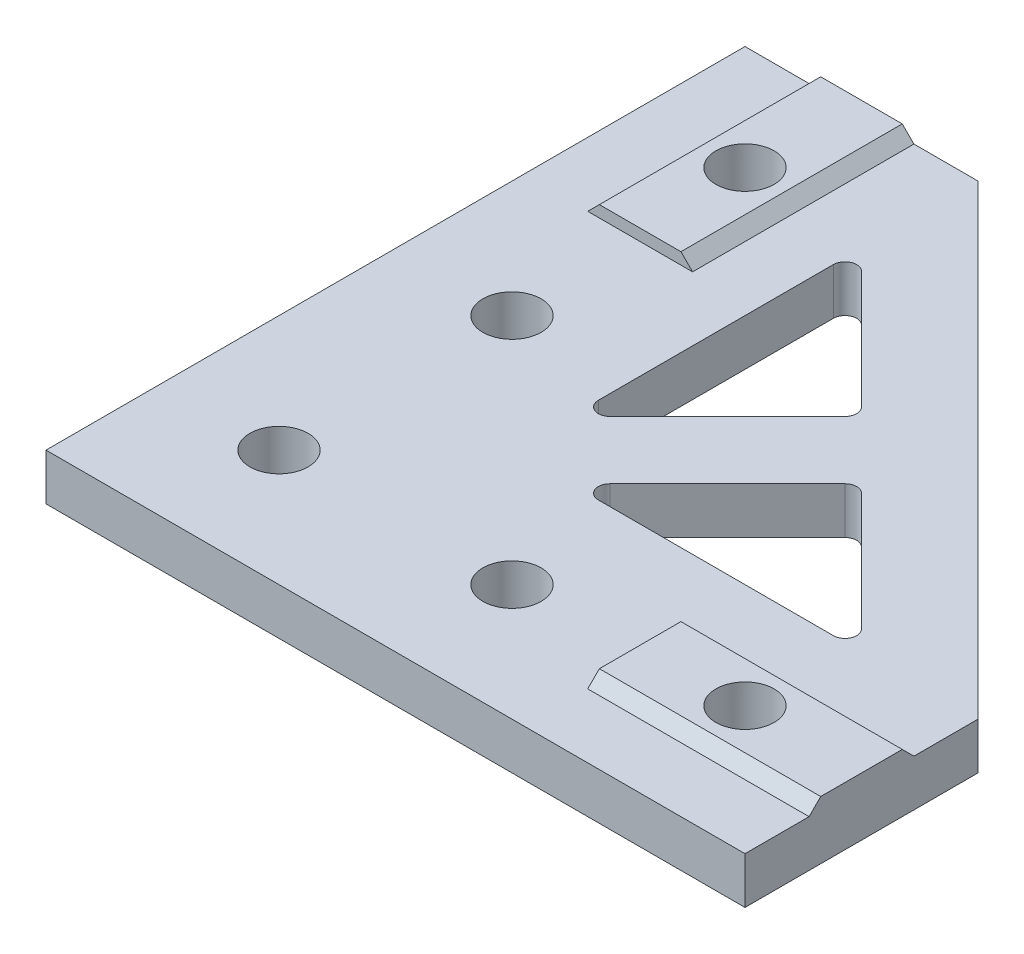
ISO-10303-21;
HEADER;
FILE_DESCRIPTION(('STEP AP214'),'2;1');
FILE_NAME('part.step','',(''),(''),'','','');
FILE_SCHEMA(('AUTOMOTIVE_DESIGN { 1 0 10303 214 1 1 1 1 }'));
ENDSEC;
DATA;
#1=APPLICATION_CONTEXT('core data for automotive mechanical design processes');
#2=APPLICATION_PROTOCOL_DEFINITION('international standard','automotive_design',2000,#1);
#3=PRODUCT_CONTEXT('',#1,'mechanical');
#4=PRODUCT('Part','Part','',(#3));
#5=PRODUCT_RELATED_PRODUCT_CATEGORY('part','',(#4));
#6=PRODUCT_DEFINITION_FORMATION('','',#4);
#7=PRODUCT_DEFINITION_CONTEXT('part definition',#1,'design');
#8=PRODUCT_DEFINITION('design','',#6,#7);
#9=PRODUCT_DEFINITION_SHAPE('','',#8);
#10=(LENGTH_UNIT() NAMED_UNIT(*) SI_UNIT(.MILLI.,.METRE.));
#11=(NAMED_UNIT(*) PLANE_ANGLE_UNIT() SI_UNIT($,.RADIAN.));
#12=(NAMED_UNIT(*) SI_UNIT($,.STERADIAN.) SOLID_ANGLE_UNIT());
#13=UNCERTAINTY_MEASURE_WITH_UNIT(LENGTH_MEASURE(1.E-05),#10,'distance_accuracy_value','');
#14=(GEOMETRIC_REPRESENTATION_CONTEXT(3) GLOBAL_UNCERTAINTY_ASSIGNED_CONTEXT((#13)) GLOBAL_UNIT_ASSIGNED_CONTEXT((#10,
#11,#12)) REPRESENTATION_CONTEXT('',''));
#15=CARTESIAN_POINT('',(0.,0.,0.));
#16=DIRECTION('',(0.,0.,1.));
#17=DIRECTION('',(1.,0.,0.));
#18=AXIS2_PLACEMENT_3D('',#15,#16,#17);
#19=CARTESIAN_POINT('',(0.,4.,0.));
#20=DIRECTION('',(0.,1.,0.));
#21=DIRECTION('',(0.,0.,1.));
#22=AXIS2_PLACEMENT_3D('',#19,#20,#21);
#23=PLANE('',#22);
#24=CARTESIAN_POINT('',(47.5858823380867,4.,-21.));
#25=DIRECTION('',(0.,1.,0.));
#26=DIRECTION('',(0.,0.,1.));
#27=AXIS2_PLACEMENT_3D('',#24,#25,#26);
#28=CIRCLE('',#27,1.);
#29=CARTESIAN_POINT('',(47.5858823380867,4.,-20.));
#30=VERTEX_POINT('',#29);
#31=CARTESIAN_POINT('',(48.2929891192733,4.,-21.7071067811866));
#32=VERTEX_POINT('',#31);
#33=EDGE_CURVE('E146',#30,#32,#28,.T.);
#34=ORIENTED_EDGE('',*,*,#33,.F.);
#35=DIRECTION('',(1.,0.,0.));
#36=VECTOR('',#35,1.);
#37=CARTESIAN_POINT('',(0.,4.,-20.));
#38=LINE('',#37,#36);
#39=CARTESIAN_POINT('',(27.4141656121432,4.,-20.));
#40=VERTEX_POINT('',#39);
#41=EDGE_CURVE('E104',#40,#30,#38,.T.);
#42=ORIENTED_EDGE('',*,*,#41,.F.);
#43=CARTESIAN_POINT('',(27.4141656121432,4.,-21.));
#44=DIRECTION('',(0.,1.,0.));
#45=DIRECTION('',(0.,0.,1.));
#46=AXIS2_PLACEMENT_3D('',#43,#44,#45);
#47=CIRCLE('',#46,1.);
#48=CARTESIAN_POINT('',(26.7070588309566,4.,-21.7071067811866));
#49=VERTEX_POINT('',#48);
#50=EDGE_CURVE('E350',#49,#40,#47,.T.);
#51=ORIENTED_EDGE('',*,*,#50,.F.);
#52=DIRECTION('',(-0.707106781186548,0.,0.707106781186548));
#53=VECTOR('',#52,1.);
#54=CARTESIAN_POINT('',(2.49997602488504,4.,2.49997602488504));
#55=LINE('',#54,#53);
#56=CARTESIAN_POINT('',(36.7929171939284,4.,-31.7929651441583));
#57=VERTEX_POINT('',#56);
#58=EDGE_CURVE('E352',#57,#49,#55,.T.);
#59=ORIENTED_EDGE('',*,*,#58,.F.);
#60=CARTESIAN_POINT('',(37.500023975115,4.,-31.0858583629718));
#61=DIRECTION('',(0.,1.,0.));
#62=DIRECTION('',(0.,0.,1.));
#63=AXIS2_PLACEMENT_3D('',#60,#61,#62);
#64=CIRCLE('',#63,1.);
#65=CARTESIAN_POINT('',(38.2071307563015,4.,-31.7929651441583));
#66=VERTEX_POINT('',#65);
#67=EDGE_CURVE('E355',#66,#57,#64,.T.);
#68=ORIENTED_EDGE('',*,*,#67,.F.);
#69=DIRECTION('',(-0.707106781186547,0.,-0.707106781186548));
#70=VECTOR('',#69,1.);
#71=CARTESIAN_POINT('',(35.0000479502299,4.,-35.0000479502299));
#72=LINE('',#71,#70);
#73=EDGE_CURVE('E358',#32,#66,#72,.T.);
#74=ORIENTED_EDGE('',*,*,#73,.F.);
#75=EDGE_LOOP('',(#34,#42,#51,#59,#68,#74));
#76=FACE_BOUND('',#75,.T.);
#77=CARTESIAN_POINT('',(31.0858583629718,4.,-37.500023975115));
#78=DIRECTION('',(0.,1.,0.));
#79=DIRECTION('',(0.,0.,1.));
#80=AXIS2_PLACEMENT_3D('',#77,#78,#79);
#81=CIRCLE('',#80,1.);
#82=CARTESIAN_POINT('',(31.7929651441583,4.,-36.7929171939284));
#83=VERTEX_POINT('',#82);
#84=CARTESIAN_POINT('',(31.7929651441583,4.,-38.2071307563015));
#85=VERTEX_POINT('',#84);
#86=EDGE_CURVE('E300',#83,#85,#81,.T.);
#87=ORIENTED_EDGE('',*,*,#86,.F.);
#88=DIRECTION('',(0.707106781186548,0.,-0.707106781186547));
#89=VECTOR('',#88,1.);
#90=CARTESIAN_POINT('',(-2.49997602488504,4.,-2.49997602488504));
#91=LINE('',#90,#89);
#92=CARTESIAN_POINT('',(21.7071067811865,4.,-26.7070588309566));
#93=VERTEX_POINT('',#92);
#94=EDGE_CURVE('E334',#93,#83,#91,.T.);
#95=ORIENTED_EDGE('',*,*,#94,.F.);
#96=CARTESIAN_POINT('',(21.,4.,-27.4141656121432));
#97=DIRECTION('',(0.,1.,0.));
#98=DIRECTION('',(0.,0.,1.));
#99=AXIS2_PLACEMENT_3D('',#96,#97,#98);
#100=CIRCLE('',#99,0.999999999999998);
#101=CARTESIAN_POINT('',(20.,4.,-27.4141656121432));
#102=VERTEX_POINT('',#101);
#103=EDGE_CURVE('E337',#102,#93,#100,.T.);
#104=ORIENTED_EDGE('',*,*,#103,.F.);
#105=DIRECTION('',(0.,0.,1.));
#106=VECTOR('',#105,1.);
#107=CARTESIAN_POINT('',(20.,4.,0.));
#108=LINE('',#107,#106);
#109=CARTESIAN_POINT('',(20.,4.,-47.5858823380867));
#110=VERTEX_POINT('',#109);
#111=EDGE_CURVE('E340',#110,#102,#108,.T.);
#112=ORIENTED_EDGE('',*,*,#111,.F.);
#113=CARTESIAN_POINT('',(21.,4.,-47.5858823380867));
#114=DIRECTION('',(0.,1.,0.));
#115=DIRECTION('',(0.,0.,1.));
#116=AXIS2_PLACEMENT_3D('',#113,#114,#115);
#117=CIRCLE('',#116,1.);
#118=CARTESIAN_POINT('',(21.7071067811866,4.,-48.2929891192733));
#119=VERTEX_POINT('',#118);
#120=EDGE_CURVE('E343',#119,#110,#117,.T.);
#121=ORIENTED_EDGE('',*,*,#120,.F.);
#122=DIRECTION('',(-0.707106781186548,0.,-0.707106781186547));
#123=VECTOR('',#122,1.);
#124=CARTESIAN_POINT('',(35.0000479502299,4.,-35.0000479502299));
#125=LINE('',#124,#123);
#126=EDGE_CURVE('E346',#85,#119,#125,.T.);
#127=ORIENTED_EDGE('',*,*,#126,.F.);
#128=EDGE_LOOP('',(#87,#95,#104,#112,#121,#127));
#129=FACE_BOUND('',#128,.T.);
#130=CARTESIAN_POINT('',(10.,4.,-30.));
#131=DIRECTION('',(0.,1.,0.));
#132=DIRECTION('',(0.,0.,1.));
#133=AXIS2_PLACEMENT_3D('',#130,#131,#132);
#134=CIRCLE('',#133,2.5);
#135=CARTESIAN_POINT('',(10.,4.,-27.5));
#136=VERTEX_POINT('',#135);
#137=EDGE_CURVE('E272',#136,#136,#134,.T.);
#138=ORIENTED_EDGE('',*,*,#137,.F.);
#139=EDGE_LOOP('',(#138));
#140=FACE_BOUND('',#139,.T.);
#141=CARTESIAN_POINT('',(10.,4.,-10.));
#142=DIRECTION('',(0.,1.,0.));
#143=DIRECTION('',(0.,0.,1.));
#144=AXIS2_PLACEMENT_3D('',#141,#142,#143);
#145=CIRCLE('',#144,2.5);
#146=CARTESIAN_POINT('',(10.,4.,-7.5));
#147=VERTEX_POINT('',#146);
#148=EDGE_CURVE('E268',#147,#147,#145,.T.);
#149=ORIENTED_EDGE('',*,*,#148,.F.);
#150=EDGE_LOOP('',(#149));
#151=FACE_BOUND('',#150,.T.);
#152=CARTESIAN_POINT('',(30.,4.,-10.));
#153=DIRECTION('',(0.,1.,0.));
#154=DIRECTION('',(0.,0.,1.));
#155=AXIS2_PLACEMENT_3D('',#152,#153,#154);
#156=CIRCLE('',#155,2.50000000000001);
#157=CARTESIAN_POINT('',(30.,4.,-7.49999999999999));
#158=VERTEX_POINT('',#157);
#159=EDGE_CURVE('E263',#158,#158,#156,.T.);
#160=ORIENTED_EDGE('',*,*,#159,.F.);
#161=EDGE_LOOP('',(#160));
#162=FACE_BOUND('',#161,.T.);
#163=DIRECTION('',(0.,0.,1.));
#164=VECTOR('',#163,1.);
#165=CARTESIAN_POINT('',(41.,4.,-5.5));
#166=LINE('',#165,#164);
#167=CARTESIAN_POINT('',(41.,4.,-14.5));
#168=VERTEX_POINT('',#167);
#169=CARTESIAN_POINT('',(41.,4.,-5.5));
#170=VERTEX_POINT('',#169);
#171=EDGE_CURVE('E378',#168,#170,#166,.T.);
#172=ORIENTED_EDGE('',*,*,#171,.F.);
#173=DIRECTION('',(-1.,0.,0.));
#174=VECTOR('',#173,1.);
#175=CARTESIAN_POINT('',(60.,4.,-14.5));
#176=LINE('',#175,#174);
#177=CARTESIAN_POINT('',(60.,4.,-14.5));
#178=VERTEX_POINT('',#177);
#179=EDGE_CURVE('E367',#178,#168,#176,.T.);
#180=ORIENTED_EDGE('',*,*,#179,.F.);
#181=DIRECTION('',(0.,0.,-1.));
#182=VECTOR('',#181,1.);
#183=CARTESIAN_POINT('',(60.,4.,0.));
#184=LINE('',#183,#182);
#185=CARTESIAN_POINT('',(60.,4.,-20.));
#186=VERTEX_POINT('',#185);
#187=EDGE_CURVE('E391',#178,#186,#184,.T.);
#188=ORIENTED_EDGE('',*,*,#187,.T.);
#189=DIRECTION('',(-0.707106781186548,0.,-0.707106781186548));
#190=VECTOR('',#189,1.);
#191=CARTESIAN_POINT('',(60.,4.,-20.));
#192=LINE('',#191,#190);
#193=CARTESIAN_POINT('',(20.,4.,-60.));
#194=VERTEX_POINT('',#193);
#195=EDGE_CURVE('E396',#186,#194,#192,.T.);
#196=ORIENTED_EDGE('',*,*,#195,.T.);
#197=DIRECTION('',(-1.,0.,0.));
#198=VECTOR('',#197,1.);
#199=CARTESIAN_POINT('',(20.,4.,-60.));
#200=LINE('',#199,#198);
#201=CARTESIAN_POINT('',(14.5,4.,-60.));
#202=VERTEX_POINT('',#201);
#203=EDGE_CURVE('E399',#194,#202,#200,.T.);
#204=ORIENTED_EDGE('',*,*,#203,.T.);
#205=DIRECTION('',(0.,0.,-1.));
#206=VECTOR('',#205,1.);
#207=CARTESIAN_POINT('',(14.5,4.,-60.));
#208=LINE('',#207,#206);
#209=CARTESIAN_POINT('',(14.5,4.,-41.));
#210=VERTEX_POINT('',#209);
#211=EDGE_CURVE('E375',#210,#202,#208,.T.);
#212=ORIENTED_EDGE('',*,*,#211,.F.);
#213=DIRECTION('',(1.,0.,0.));
#214=VECTOR('',#213,1.);
#215=CARTESIAN_POINT('',(14.5,4.,-41.));
#216=LINE('',#215,#214);
#217=CARTESIAN_POINT('',(5.5,4.,-41.));
#218=VERTEX_POINT('',#217);
#219=EDGE_CURVE('E230',#218,#210,#216,.T.);
#220=ORIENTED_EDGE('',*,*,#219,.F.);
#221=DIRECTION('',(0.,0.,1.));
#222=VECTOR('',#221,1.);
#223=CARTESIAN_POINT('',(5.5,4.,-60.));
#224=LINE('',#223,#222);
#225=CARTESIAN_POINT('',(5.5,4.,-60.));
#226=VERTEX_POINT('',#225);
#227=EDGE_CURVE('E384',#226,#218,#224,.T.);
#228=ORIENTED_EDGE('',*,*,#227,.F.);
#229=CARTESIAN_POINT('',(0.,4.,-60.));
#230=VERTEX_POINT('',#229);
#231=EDGE_CURVE('E398',#226,#230,#200,.T.);
#232=ORIENTED_EDGE('',*,*,#231,.T.);
#233=DIRECTION('',(0.,0.,1.));
#234=VECTOR('',#233,1.);
#235=CARTESIAN_POINT('',(0.,4.,0.));
#236=LINE('',#235,#234);
#237=CARTESIAN_POINT('',(0.,4.,0.));
#238=VERTEX_POINT('',#237);
#239=EDGE_CURVE('E402',#230,#238,#236,.T.);
#240=ORIENTED_EDGE('',*,*,#239,.T.);
#241=DIRECTION('',(1.,0.,0.));
#242=VECTOR('',#241,1.);
#243=CARTESIAN_POINT('',(0.,4.,0.));
#244=LINE('',#243,#242);
#245=CARTESIAN_POINT('',(60.,4.,0.));
#246=VERTEX_POINT('',#245);
#247=EDGE_CURVE('E388',#238,#246,#244,.T.);
#248=ORIENTED_EDGE('',*,*,#247,.T.);
#249=CARTESIAN_POINT('',(60.,4.,-5.5));
#250=VERTEX_POINT('',#249);
#251=EDGE_CURVE('E393',#246,#250,#184,.T.);
#252=ORIENTED_EDGE('',*,*,#251,.T.);
#253=DIRECTION('',(1.,0.,0.));
#254=VECTOR('',#253,1.);
#255=CARTESIAN_POINT('',(60.,4.,-5.5));
#256=LINE('',#255,#254);
#257=EDGE_CURVE('E372',#170,#250,#256,.T.);
#258=ORIENTED_EDGE('',*,*,#257,.F.);
#259=EDGE_LOOP('',(#172,#180,#188,#196,#204,#212,#220,#228,#232,#240,#248,#252,#258));
#260=FACE_BOUND('',#259,.T.);
#261=ADVANCED_FACE('F33',(#76,#129,#140,#151,#162,#260),#23,.T.);
#262=CARTESIAN_POINT('',(0.,4.,0.));
#263=DIRECTION('',(0.,0.,-1.));
#264=DIRECTION('',(-1.,0.,0.));
#265=AXIS2_PLACEMENT_3D('',#262,#263,#264);
#266=PLANE('',#265);
#267=DIRECTION('',(1.,0.,0.));
#268=VECTOR('',#267,1.);
#269=CARTESIAN_POINT('',(0.,0.,0.));
#270=LINE('',#269,#268);
#271=CARTESIAN_POINT('',(0.,0.,0.));
#272=VERTEX_POINT('',#271);
#273=CARTESIAN_POINT('',(60.,0.,0.));
#274=VERTEX_POINT('',#273);
#275=EDGE_CURVE('E246',#272,#274,#270,.T.);
#276=ORIENTED_EDGE('',*,*,#275,.T.);
#277=DIRECTION('',(0.,-1.,0.));
#278=VECTOR('',#277,1.);
#279=CARTESIAN_POINT('',(60.,4.,0.));
#280=LINE('',#279,#278);
#281=EDGE_CURVE('E425',#246,#274,#280,.T.);
#282=ORIENTED_EDGE('',*,*,#281,.F.);
#283=ORIENTED_EDGE('',*,*,#247,.F.);
#284=DIRECTION('',(0.,-1.,0.));
#285=VECTOR('',#284,1.);
#286=CARTESIAN_POINT('',(0.,4.,0.));
#287=LINE('',#286,#285);
#288=EDGE_CURVE('E404',#238,#272,#287,.T.);
#289=ORIENTED_EDGE('',*,*,#288,.T.);
#290=EDGE_LOOP('',(#276,#282,#283,#289));
#291=FACE_BOUND('',#290,.T.);
#292=ADVANCED_FACE('F465',(#291),#266,.F.);
#293=CARTESIAN_POINT('',(60.,4.,0.));
#294=DIRECTION('',(-1.,0.,0.));
#295=DIRECTION('',(0.,0.,1.));
#296=AXIS2_PLACEMENT_3D('',#293,#294,#295);
#297=PLANE('',#296);
#298=ORIENTED_EDGE('',*,*,#187,.F.);
#299=DIRECTION('',(0.,0.70710678118655,0.707106781186545));
#300=VECTOR('',#299,1.);
#301=CARTESIAN_POINT('',(60.,5.00000000000001,-13.5));
#302=LINE('',#301,#300);
#303=CARTESIAN_POINT('',(60.,5.,-13.5));
#304=VERTEX_POINT('',#303);
#305=EDGE_CURVE('E254',#178,#304,#302,.T.);
#306=ORIENTED_EDGE('',*,*,#305,.T.);
#307=DIRECTION('',(0.,0.,-1.));
#308=VECTOR('',#307,1.);
#309=CARTESIAN_POINT('',(60.,5.,-5.5));
#310=LINE('',#309,#308);
#311=CARTESIAN_POINT('',(60.,5.,-6.49999999999999));
#312=VERTEX_POINT('',#311);
#313=EDGE_CURVE('E368',#312,#304,#310,.T.);
#314=ORIENTED_EDGE('',*,*,#313,.F.);
#315=DIRECTION('',(0.,-0.70710678118655,0.707106781186545));
#316=VECTOR('',#315,1.);
#317=CARTESIAN_POINT('',(60.,5.,-6.49999999999999));
#318=LINE('',#317,#316);
#319=EDGE_CURVE('E438',#312,#250,#318,.T.);
#320=ORIENTED_EDGE('',*,*,#319,.T.);
#321=ORIENTED_EDGE('',*,*,#251,.F.);
#322=ORIENTED_EDGE('',*,*,#281,.T.);
#323=DIRECTION('',(0.,0.,-1.));
#324=VECTOR('',#323,1.);
#325=CARTESIAN_POINT('',(60.,0.,0.));
#326=LINE('',#325,#324);
#327=CARTESIAN_POINT('',(60.,0.,-20.));
#328=VERTEX_POINT('',#327);
#329=EDGE_CURVE('E407',#274,#328,#326,.T.);
#330=ORIENTED_EDGE('',*,*,#329,.T.);
#331=DIRECTION('',(0.,-1.,0.));
#332=VECTOR('',#331,1.);
#333=CARTESIAN_POINT('',(60.,4.,-20.));
#334=LINE('',#333,#332);
#335=EDGE_CURVE('E422',#186,#328,#334,.T.);
#336=ORIENTED_EDGE('',*,*,#335,.F.);
#337=EDGE_LOOP('',(#298,#306,#314,#320,#321,#322,#330,#336));
#338=FACE_BOUND('',#337,.T.);
#339=ADVANCED_FACE('F443',(#338),#297,.F.);
#340=CARTESIAN_POINT('',(60.,4.,-20.));
#341=DIRECTION('',(-0.707106781186547,0.,0.707106781186547));
#342=DIRECTION('',(0.707106781186548,0.,0.707106781186548));
#343=AXIS2_PLACEMENT_3D('',#340,#341,#342);
#344=PLANE('',#343);
#345=DIRECTION('',(-0.707106781186548,0.,-0.707106781186548));
#346=VECTOR('',#345,1.);
#347=CARTESIAN_POINT('',(60.,0.,-20.));
#348=LINE('',#347,#346);
#349=CARTESIAN_POINT('',(20.,0.,-60.));
#350=VERTEX_POINT('',#349);
#351=EDGE_CURVE('E409',#328,#350,#348,.T.);
#352=ORIENTED_EDGE('',*,*,#351,.T.);
#353=DIRECTION('',(0.,-1.,0.));
#354=VECTOR('',#353,1.);
#355=CARTESIAN_POINT('',(20.,4.,-60.));
#356=LINE('',#355,#354);
#357=EDGE_CURVE('E419',#194,#350,#356,.T.);
#358=ORIENTED_EDGE('',*,*,#357,.F.);
#359=ORIENTED_EDGE('',*,*,#195,.F.);
#360=ORIENTED_EDGE('',*,*,#335,.T.);
#361=EDGE_LOOP('',(#352,#358,#359,#360));
#362=FACE_BOUND('',#361,.T.);
#363=ADVANCED_FACE('F473',(#362),#344,.F.);
#364=CARTESIAN_POINT('',(20.,4.,-60.));
#365=DIRECTION('',(0.,0.,1.));
#366=DIRECTION('',(1.,0.,0.));
#367=AXIS2_PLACEMENT_3D('',#364,#365,#366);
#368=PLANE('',#367);
#369=DIRECTION('',(-1.,0.,0.));
#370=VECTOR('',#369,1.);
#371=CARTESIAN_POINT('',(14.5,5.,-60.));
#372=LINE('',#371,#370);
#373=CARTESIAN_POINT('',(13.5,5.,-60.));
#374=VERTEX_POINT('',#373);
#375=CARTESIAN_POINT('',(6.49999999999999,5.,-60.));
#376=VERTEX_POINT('',#375);
#377=EDGE_CURVE('E247',#374,#376,#372,.T.);
#378=ORIENTED_EDGE('',*,*,#377,.F.);
#379=DIRECTION('',(-0.707106781186545,0.707106781186551,0.));
#380=VECTOR('',#379,1.);
#381=CARTESIAN_POINT('',(13.5,5.,-60.));
#382=LINE('',#381,#380);
#383=EDGE_CURVE('E250',#374,#202,#382,.F.);
#384=ORIENTED_EDGE('',*,*,#383,.T.);
#385=ORIENTED_EDGE('',*,*,#203,.F.);
#386=ORIENTED_EDGE('',*,*,#357,.T.);
#387=DIRECTION('',(-1.,0.,0.));
#388=VECTOR('',#387,1.);
#389=CARTESIAN_POINT('',(20.,0.,-60.));
#390=LINE('',#389,#388);
#391=CARTESIAN_POINT('',(0.,0.,-60.));
#392=VERTEX_POINT('',#391);
#393=EDGE_CURVE('E411',#350,#392,#390,.T.);
#394=ORIENTED_EDGE('',*,*,#393,.T.);
#395=DIRECTION('',(0.,-1.,0.));
#396=VECTOR('',#395,1.);
#397=CARTESIAN_POINT('',(0.,4.,-60.));
#398=LINE('',#397,#396);
#399=EDGE_CURVE('E416',#230,#392,#398,.T.);
#400=ORIENTED_EDGE('',*,*,#399,.F.);
#401=ORIENTED_EDGE('',*,*,#231,.F.);
#402=DIRECTION('',(-0.707106781186545,-0.70710678118655,0.));
#403=VECTOR('',#402,1.);
#404=CARTESIAN_POINT('',(6.5,5.,-60.));
#405=LINE('',#404,#403);
#406=EDGE_CURVE('E251',#226,#376,#405,.F.);
#407=ORIENTED_EDGE('',*,*,#406,.T.);
#408=EDGE_LOOP('',(#378,#384,#385,#386,#394,#400,#401,#407));
#409=FACE_BOUND('',#408,.T.);
#410=ADVANCED_FACE('F477',(#409),#368,.F.);
#411=CARTESIAN_POINT('',(0.,4.,0.));
#412=DIRECTION('',(1.,0.,0.));
#413=DIRECTION('',(0.,0.,-1.));
#414=AXIS2_PLACEMENT_3D('',#411,#412,#413);
#415=PLANE('',#414);
#416=DIRECTION('',(0.,0.,1.));
#417=VECTOR('',#416,1.);
#418=CARTESIAN_POINT('',(0.,0.,0.));
#419=LINE('',#418,#417);
#420=EDGE_CURVE('E392',#392,#272,#419,.T.);
#421=ORIENTED_EDGE('',*,*,#420,.T.);
#422=ORIENTED_EDGE('',*,*,#288,.F.);
#423=ORIENTED_EDGE('',*,*,#239,.F.);
#424=ORIENTED_EDGE('',*,*,#399,.T.);
#425=EDGE_LOOP('',(#421,#422,#423,#424));
#426=FACE_BOUND('',#425,.T.);
#427=ADVANCED_FACE('F483',(#426),#415,.F.);
#428=CARTESIAN_POINT('',(0.,0.,0.));
#429=DIRECTION('',(0.,1.,0.));
#430=DIRECTION('',(0.,0.,1.));
#431=AXIS2_PLACEMENT_3D('',#428,#429,#430);
#432=PLANE('',#431);
#433=DIRECTION('',(1.,0.,0.));
#434=VECTOR('',#433,1.);
#435=CARTESIAN_POINT('',(0.,0.,-20.));
#436=LINE('',#435,#434);
#437=CARTESIAN_POINT('',(27.4141656121432,0.,-20.));
#438=VERTEX_POINT('',#437);
#439=CARTESIAN_POINT('',(47.5858823380867,0.,-20.));
#440=VERTEX_POINT('',#439);
#441=EDGE_CURVE('E102',#438,#440,#436,.T.);
#442=ORIENTED_EDGE('',*,*,#441,.T.);
#443=CARTESIAN_POINT('',(47.5858823380867,0.,-21.));
#444=DIRECTION('',(0.,-1.,0.));
#445=DIRECTION('',(0.,0.,-1.));
#446=AXIS2_PLACEMENT_3D('',#443,#444,#445);
#447=CIRCLE('',#446,1.);
#448=CARTESIAN_POINT('',(48.2929891192733,0.,-21.7071067811866));
#449=VERTEX_POINT('',#448);
#450=EDGE_CURVE('E11',#440,#449,#447,.F.);
#451=ORIENTED_EDGE('',*,*,#450,.T.);
#452=DIRECTION('',(-0.707106781186547,0.,-0.707106781186548));
#453=VECTOR('',#452,1.);
#454=CARTESIAN_POINT('',(48.2929891192733,0.,-21.7071067811865));
#455=LINE('',#454,#453);
#456=CARTESIAN_POINT('',(38.2071307563015,0.,-31.7929651441583));
#457=VERTEX_POINT('',#456);
#458=EDGE_CURVE('E42',#449,#457,#455,.T.);
#459=ORIENTED_EDGE('',*,*,#458,.T.);
#460=CARTESIAN_POINT('',(37.500023975115,0.,-31.0858583629718));
#461=DIRECTION('',(0.,-1.,0.));
#462=DIRECTION('',(0.,0.,-1.));
#463=AXIS2_PLACEMENT_3D('',#460,#461,#462);
#464=CIRCLE('',#463,1.);
#465=CARTESIAN_POINT('',(36.7929171939284,0.,-31.7929651441583));
#466=VERTEX_POINT('',#465);
#467=EDGE_CURVE('E131',#457,#466,#464,.F.);
#468=ORIENTED_EDGE('',*,*,#467,.T.);
#469=DIRECTION('',(-0.707106781186548,0.,0.707106781186548));
#470=VECTOR('',#469,1.);
#471=CARTESIAN_POINT('',(36.7929171939284,0.,-31.7929651441583));
#472=LINE('',#471,#470);
#473=CARTESIAN_POINT('',(26.7070588309566,0.,-21.7071067811866));
#474=VERTEX_POINT('',#473);
#475=EDGE_CURVE('E123',#466,#474,#472,.T.);
#476=ORIENTED_EDGE('',*,*,#475,.T.);
#477=CARTESIAN_POINT('',(27.4141656121432,0.,-21.));
#478=DIRECTION('',(0.,-1.,0.));
#479=DIRECTION('',(0.,0.,-1.));
#480=AXIS2_PLACEMENT_3D('',#477,#478,#479);
#481=CIRCLE('',#480,1.);
#482=EDGE_CURVE('E120',#474,#438,#481,.F.);
#483=ORIENTED_EDGE('',*,*,#482,.T.);
#484=EDGE_LOOP('',(#442,#451,#459,#468,#476,#483));
#485=FACE_BOUND('',#484,.T.);
#486=DIRECTION('',(0.707106781186548,0.,-0.707106781186547));
#487=VECTOR('',#486,1.);
#488=CARTESIAN_POINT('',(21.7071067811865,0.,-26.7070588309566));
#489=LINE('',#488,#487);
#490=CARTESIAN_POINT('',(21.7071067811866,0.,-26.7070588309566));
#491=VERTEX_POINT('',#490);
#492=CARTESIAN_POINT('',(31.7929651441583,0.,-36.7929171939284));
#493=VERTEX_POINT('',#492);
#494=EDGE_CURVE('E234',#491,#493,#489,.T.);
#495=ORIENTED_EDGE('',*,*,#494,.T.);
#496=CARTESIAN_POINT('',(31.0858583629718,0.,-37.500023975115));
#497=DIRECTION('',(0.,-1.,0.));
#498=DIRECTION('',(0.,0.,-1.));
#499=AXIS2_PLACEMENT_3D('',#496,#497,#498);
#500=CIRCLE('',#499,1.);
#501=CARTESIAN_POINT('',(31.7929651441583,0.,-38.2071307563015));
#502=VERTEX_POINT('',#501);
#503=EDGE_CURVE('E121',#493,#502,#500,.F.);
#504=ORIENTED_EDGE('',*,*,#503,.T.);
#505=DIRECTION('',(-0.707106781186548,0.,-0.707106781186547));
#506=VECTOR('',#505,1.);
#507=CARTESIAN_POINT('',(31.7929651441583,0.,-38.2071307563015));
#508=LINE('',#507,#506);
#509=CARTESIAN_POINT('',(21.7071067811865,0.,-48.2929891192733));
#510=VERTEX_POINT('',#509);
#511=EDGE_CURVE('E126',#502,#510,#508,.T.);
#512=ORIENTED_EDGE('',*,*,#511,.T.);
#513=CARTESIAN_POINT('',(21.,0.,-47.5858823380867));
#514=DIRECTION('',(0.,-1.,0.));
#515=DIRECTION('',(0.,0.,-1.));
#516=AXIS2_PLACEMENT_3D('',#513,#514,#515);
#517=CIRCLE('',#516,1.);
#518=CARTESIAN_POINT('',(20.,0.,-47.5858823380867));
#519=VERTEX_POINT('',#518);
#520=EDGE_CURVE('E281',#510,#519,#517,.F.);
#521=ORIENTED_EDGE('',*,*,#520,.T.);
#522=DIRECTION('',(0.,0.,1.));
#523=VECTOR('',#522,1.);
#524=CARTESIAN_POINT('',(20.,0.,0.));
#525=LINE('',#524,#523);
#526=CARTESIAN_POINT('',(20.,0.,-27.4141656121432));
#527=VERTEX_POINT('',#526);
#528=EDGE_CURVE('E278',#519,#527,#525,.T.);
#529=ORIENTED_EDGE('',*,*,#528,.T.);
#530=CARTESIAN_POINT('',(21.,0.,-27.4141656121432));
#531=DIRECTION('',(0.,-1.,0.));
#532=DIRECTION('',(0.,0.,-1.));
#533=AXIS2_PLACEMENT_3D('',#530,#531,#532);
#534=CIRCLE('',#533,0.999999999999998);
#535=EDGE_CURVE('E275',#527,#491,#534,.F.);
#536=ORIENTED_EDGE('',*,*,#535,.T.);
#537=EDGE_LOOP('',(#495,#504,#512,#521,#529,#536));
#538=FACE_BOUND('',#537,.T.);
#539=CARTESIAN_POINT('',(10.,0.,-50.));
#540=DIRECTION('',(0.,1.,0.));
#541=DIRECTION('',(0.,0.,1.));
#542=AXIS2_PLACEMENT_3D('',#539,#540,#541);
#543=CIRCLE('',#542,2.5);
#544=CARTESIAN_POINT('',(10.,0.,-47.5));
#545=VERTEX_POINT('',#544);
#546=EDGE_CURVE('E264',#545,#545,#543,.T.);
#547=ORIENTED_EDGE('',*,*,#546,.T.);
#548=EDGE_LOOP('',(#547));
#549=FACE_BOUND('',#548,.T.);
#550=CARTESIAN_POINT('',(10.,0.,-30.));
#551=DIRECTION('',(0.,1.,0.));
#552=DIRECTION('',(0.,0.,1.));
#553=AXIS2_PLACEMENT_3D('',#550,#551,#552);
#554=CIRCLE('',#553,2.5);
#555=CARTESIAN_POINT('',(10.,0.,-27.5));
#556=VERTEX_POINT('',#555);
#557=EDGE_CURVE('E269',#556,#556,#554,.T.);
#558=ORIENTED_EDGE('',*,*,#557,.T.);
#559=EDGE_LOOP('',(#558));
#560=FACE_BOUND('',#559,.T.);
#561=CARTESIAN_POINT('',(10.,0.,-10.));
#562=DIRECTION('',(0.,1.,0.));
#563=DIRECTION('',(0.,0.,1.));
#564=AXIS2_PLACEMENT_3D('',#561,#562,#563);
#565=CIRCLE('',#564,2.5);
#566=CARTESIAN_POINT('',(10.,0.,-7.5));
#567=VERTEX_POINT('',#566);
#568=EDGE_CURVE('E265',#567,#567,#565,.T.);
#569=ORIENTED_EDGE('',*,*,#568,.T.);
#570=EDGE_LOOP('',(#569));
#571=FACE_BOUND('',#570,.T.);
#572=CARTESIAN_POINT('',(30.,0.,-10.));
#573=DIRECTION('',(0.,1.,0.));
#574=DIRECTION('',(0.,0.,1.));
#575=AXIS2_PLACEMENT_3D('',#572,#573,#574);
#576=CIRCLE('',#575,2.50000000000001);
#577=CARTESIAN_POINT('',(30.,0.,-7.49999999999999));
#578=VERTEX_POINT('',#577);
#579=EDGE_CURVE('E260',#578,#578,#576,.T.);
#580=ORIENTED_EDGE('',*,*,#579,.T.);
#581=EDGE_LOOP('',(#580));
#582=FACE_BOUND('',#581,.T.);
#583=CARTESIAN_POINT('',(50.,0.,-10.));
#584=DIRECTION('',(0.,1.,0.));
#585=DIRECTION('',(0.,0.,1.));
#586=AXIS2_PLACEMENT_3D('',#583,#584,#585);
#587=CIRCLE('',#586,2.5);
#588=CARTESIAN_POINT('',(50.,0.,-7.5));
#589=VERTEX_POINT('',#588);
#590=EDGE_CURVE('E364',#589,#589,#587,.T.);
#591=ORIENTED_EDGE('',*,*,#590,.T.);
#592=EDGE_LOOP('',(#591));
#593=FACE_BOUND('',#592,.T.);
#594=ORIENTED_EDGE('',*,*,#275,.F.);
#595=ORIENTED_EDGE('',*,*,#420,.F.);
#596=ORIENTED_EDGE('',*,*,#393,.F.);
#597=ORIENTED_EDGE('',*,*,#351,.F.);
#598=ORIENTED_EDGE('',*,*,#329,.F.);
#599=EDGE_LOOP('',(#594,#595,#596,#597,#598));
#600=FACE_BOUND('',#599,.T.);
#601=ADVANCED_FACE('F117',(#485,#538,#549,#560,#571,#582,#593,#600),#432,.F.);
#602=CARTESIAN_POINT('',(14.5,5.,-41.));
#603=DIRECTION('',(0.,0.,-1.));
#604=DIRECTION('',(-1.,0.,0.));
#605=AXIS2_PLACEMENT_3D('',#602,#603,#604);
#606=PLANE('',#605);
#607=ORIENTED_EDGE('',*,*,#219,.T.);
#608=DIRECTION('',(0.707106781186545,-0.707106781186551,0.));
#609=VECTOR('',#608,1.);
#610=CARTESIAN_POINT('',(13.5,5.,-41.));
#611=LINE('',#610,#609);
#612=CARTESIAN_POINT('',(13.5,5.,-41.));
#613=VERTEX_POINT('',#612);
#614=EDGE_CURVE('E225',#210,#613,#611,.F.);
#615=ORIENTED_EDGE('',*,*,#614,.T.);
#616=DIRECTION('',(1.,0.,0.));
#617=VECTOR('',#616,1.);
#618=CARTESIAN_POINT('',(14.5,5.,-41.));
#619=LINE('',#618,#617);
#620=CARTESIAN_POINT('',(6.5,5.,-41.));
#621=VERTEX_POINT('',#620);
#622=EDGE_CURVE('E228',#621,#613,#619,.T.);
#623=ORIENTED_EDGE('',*,*,#622,.F.);
#624=DIRECTION('',(0.707106781186545,0.70710678118655,0.));
#625=VECTOR('',#624,1.);
#626=CARTESIAN_POINT('',(6.5,5.,-41.));
#627=LINE('',#626,#625);
#628=EDGE_CURVE('E235',#621,#218,#627,.F.);
#629=ORIENTED_EDGE('',*,*,#628,.T.);
#630=EDGE_LOOP('',(#607,#615,#623,#629));
#631=FACE_BOUND('',#630,.T.);
#632=ADVANCED_FACE('F227',(#631),#606,.F.);
#633=CARTESIAN_POINT('',(0.,5.,0.));
#634=DIRECTION('',(0.,-1.,0.));
#635=DIRECTION('',(0.,0.,-1.));
#636=AXIS2_PLACEMENT_3D('',#633,#634,#635);
#637=PLANE('',#636);
#638=CARTESIAN_POINT('',(10.,5.,-50.));
#639=DIRECTION('',(0.,-1.,0.));
#640=DIRECTION('',(0.,0.,-1.));
#641=AXIS2_PLACEMENT_3D('',#638,#639,#640);
#642=CIRCLE('',#641,2.5);
#643=CARTESIAN_POINT('',(10.,5.,-52.5));
#644=VERTEX_POINT('',#643);
#645=EDGE_CURVE('E318',#644,#644,#642,.T.);
#646=ORIENTED_EDGE('',*,*,#645,.T.);
#647=EDGE_LOOP('',(#646));
#648=FACE_BOUND('',#647,.T.);
#649=ORIENTED_EDGE('',*,*,#622,.T.);
#650=DIRECTION('',(0.,0.,-1.));
#651=VECTOR('',#650,1.);
#652=CARTESIAN_POINT('',(13.5,5.,0.));
#653=LINE('',#652,#651);
#654=EDGE_CURVE('E242',#613,#374,#653,.T.);
#655=ORIENTED_EDGE('',*,*,#654,.T.);
#656=ORIENTED_EDGE('',*,*,#377,.T.);
#657=DIRECTION('',(0.,0.,1.));
#658=VECTOR('',#657,1.);
#659=CARTESIAN_POINT('',(6.5,5.,0.));
#660=LINE('',#659,#658);
#661=EDGE_CURVE('E245',#376,#621,#660,.T.);
#662=ORIENTED_EDGE('',*,*,#661,.T.);
#663=EDGE_LOOP('',(#649,#655,#656,#662));
#664=FACE_BOUND('',#663,.T.);
#665=ADVANCED_FACE('F240',(#648,#664),#637,.F.);
#666=CARTESIAN_POINT('',(41.,5.,-5.5));
#667=DIRECTION('',(1.,0.,0.));
#668=DIRECTION('',(0.,0.,-1.));
#669=AXIS2_PLACEMENT_3D('',#666,#667,#668);
#670=PLANE('',#669);
#671=DIRECTION('',(0.,0.,1.));
#672=VECTOR('',#671,1.);
#673=CARTESIAN_POINT('',(41.,5.,-5.5));
#674=LINE('',#673,#672);
#675=CARTESIAN_POINT('',(41.,5.,-13.5));
#676=VERTEX_POINT('',#675);
#677=CARTESIAN_POINT('',(41.,5.,-6.49999999999999));
#678=VERTEX_POINT('',#677);
#679=EDGE_CURVE('E371',#676,#678,#674,.T.);
#680=ORIENTED_EDGE('',*,*,#679,.F.);
#681=DIRECTION('',(0.,-0.70710678118655,-0.707106781186545));
#682=VECTOR('',#681,1.);
#683=CARTESIAN_POINT('',(41.,5.,-13.5));
#684=LINE('',#683,#682);
#685=EDGE_CURVE('E436',#676,#168,#684,.T.);
#686=ORIENTED_EDGE('',*,*,#685,.T.);
#687=ORIENTED_EDGE('',*,*,#171,.T.);
#688=DIRECTION('',(0.,0.70710678118655,-0.707106781186545));
#689=VECTOR('',#688,1.);
#690=CARTESIAN_POINT('',(41.,5.,-6.49999999999999));
#691=LINE('',#690,#689);
#692=EDGE_CURVE('E434',#170,#678,#691,.T.);
#693=ORIENTED_EDGE('',*,*,#692,.T.);
#694=EDGE_LOOP('',(#680,#686,#687,#693));
#695=FACE_BOUND('',#694,.T.);
#696=ADVANCED_FACE('F454',(#695),#670,.F.);
#697=CARTESIAN_POINT('',(0.,5.,0.));
#698=DIRECTION('',(0.,1.,0.));
#699=DIRECTION('',(0.,0.,1.));
#700=AXIS2_PLACEMENT_3D('',#697,#698,#699);
#701=PLANE('',#700);
#702=CARTESIAN_POINT('',(50.,5.,-10.));
#703=DIRECTION('',(0.,-1.,0.));
#704=DIRECTION('',(0.,0.,-1.));
#705=AXIS2_PLACEMENT_3D('',#702,#703,#704);
#706=CIRCLE('',#705,2.5);
#707=CARTESIAN_POINT('',(50.,5.,-12.5));
#708=VERTEX_POINT('',#707);
#709=EDGE_CURVE('E361',#708,#708,#706,.T.);
#710=ORIENTED_EDGE('',*,*,#709,.T.);
#711=EDGE_LOOP('',(#710));
#712=FACE_BOUND('',#711,.T.);
#713=ORIENTED_EDGE('',*,*,#313,.T.);
#714=DIRECTION('',(-1.,0.,0.));
#715=VECTOR('',#714,1.);
#716=CARTESIAN_POINT('',(41.,5.,-13.5));
#717=LINE('',#716,#715);
#718=EDGE_CURVE('E431',#304,#676,#717,.T.);
#719=ORIENTED_EDGE('',*,*,#718,.T.);
#720=ORIENTED_EDGE('',*,*,#679,.T.);
#721=DIRECTION('',(1.,0.,0.));
#722=VECTOR('',#721,1.);
#723=CARTESIAN_POINT('',(60.,5.,-6.49999999999999));
#724=LINE('',#723,#722);
#725=EDGE_CURVE('E428',#678,#312,#724,.T.);
#726=ORIENTED_EDGE('',*,*,#725,.T.);
#727=EDGE_LOOP('',(#713,#719,#720,#726));
#728=FACE_BOUND('',#727,.T.);
#729=ADVANCED_FACE('F448',(#712,#728),#701,.T.);
#730=CARTESIAN_POINT('',(0.,5.,-13.5));
#731=DIRECTION('',(0.,0.707106781186545,-0.70710678118655));
#732=DIRECTION('',(1.,0.,0.));
#733=AXIS2_PLACEMENT_3D('',#730,#731,#732);
#734=PLANE('',#733);
#735=ORIENTED_EDGE('',*,*,#305,.F.);
#736=ORIENTED_EDGE('',*,*,#179,.T.);
#737=ORIENTED_EDGE('',*,*,#685,.F.);
#738=ORIENTED_EDGE('',*,*,#718,.F.);
#739=EDGE_LOOP('',(#735,#736,#737,#738));
#740=FACE_BOUND('',#739,.T.);
#741=ADVANCED_FACE('F451',(#740),#734,.T.);
#742=CARTESIAN_POINT('',(0.,5.,-6.49999999999999));
#743=DIRECTION('',(0.,0.707106781186545,0.70710678118655));
#744=DIRECTION('',(-1.,0.,0.));
#745=AXIS2_PLACEMENT_3D('',#742,#743,#744);
#746=PLANE('',#745);
#747=ORIENTED_EDGE('',*,*,#692,.F.);
#748=ORIENTED_EDGE('',*,*,#257,.T.);
#749=ORIENTED_EDGE('',*,*,#319,.F.);
#750=ORIENTED_EDGE('',*,*,#725,.F.);
#751=EDGE_LOOP('',(#747,#748,#749,#750));
#752=FACE_BOUND('',#751,.T.);
#753=ADVANCED_FACE('F459',(#752),#746,.T.);
#754=CARTESIAN_POINT('',(13.5,5.,0.));
#755=DIRECTION('',(-0.70710678118655,-0.707106781186544,0.));
#756=DIRECTION('',(0.,0.,-1.));
#757=AXIS2_PLACEMENT_3D('',#754,#755,#756);
#758=PLANE('',#757);
#759=ORIENTED_EDGE('',*,*,#614,.F.);
#760=ORIENTED_EDGE('',*,*,#211,.T.);
#761=ORIENTED_EDGE('',*,*,#383,.F.);
#762=ORIENTED_EDGE('',*,*,#654,.F.);
#763=EDGE_LOOP('',(#759,#760,#761,#762));
#764=FACE_BOUND('',#763,.T.);
#765=ADVANCED_FACE('F249',(#764),#758,.F.);
#766=CARTESIAN_POINT('',(6.5,5.,0.));
#767=DIRECTION('',(0.70710678118655,-0.707106781186545,0.));
#768=DIRECTION('',(0.,0.,1.));
#769=AXIS2_PLACEMENT_3D('',#766,#767,#768);
#770=PLANE('',#769);
#771=ORIENTED_EDGE('',*,*,#406,.F.);
#772=ORIENTED_EDGE('',*,*,#227,.T.);
#773=ORIENTED_EDGE('',*,*,#628,.F.);
#774=ORIENTED_EDGE('',*,*,#661,.F.);
#775=EDGE_LOOP('',(#771,#772,#773,#774));
#776=FACE_BOUND('',#775,.T.);
#777=ADVANCED_FACE('F35',(#776),#770,.F.);
#778=CARTESIAN_POINT('',(50.,5.,-10.));
#779=DIRECTION('',(0.,-1.,0.));
#780=DIRECTION('',(0.,0.,-1.));
#781=AXIS2_PLACEMENT_3D('',#778,#779,#780);
#782=CYLINDRICAL_SURFACE('',#781,2.5);
#783=ORIENTED_EDGE('',*,*,#709,.F.);
#784=EDGE_LOOP('',(#783));
#785=FACE_BOUND('',#784,.T.);
#786=ORIENTED_EDGE('',*,*,#590,.F.);
#787=EDGE_LOOP('',(#786));
#788=FACE_BOUND('',#787,.T.);
#789=ADVANCED_FACE('F511',(#785,#788),#782,.F.);
#790=CARTESIAN_POINT('',(10.,5.,-50.));
#791=DIRECTION('',(0.,-1.,0.));
#792=DIRECTION('',(0.,0.,-1.));
#793=AXIS2_PLACEMENT_3D('',#790,#791,#792);
#794=CYLINDRICAL_SURFACE('',#793,2.5);
#795=ORIENTED_EDGE('',*,*,#645,.F.);
#796=EDGE_LOOP('',(#795));
#797=FACE_BOUND('',#796,.T.);
#798=ORIENTED_EDGE('',*,*,#546,.F.);
#799=EDGE_LOOP('',(#798));
#800=FACE_BOUND('',#799,.T.);
#801=ADVANCED_FACE('F514',(#797,#800),#794,.F.);
#802=CARTESIAN_POINT('',(30.,5.,-10.));
#803=DIRECTION('',(0.,-1.,0.));
#804=DIRECTION('',(0.,0.,-1.));
#805=AXIS2_PLACEMENT_3D('',#802,#803,#804);
#806=CYLINDRICAL_SURFACE('',#805,2.50000000000001);
#807=ORIENTED_EDGE('',*,*,#159,.T.);
#808=EDGE_LOOP('',(#807));
#809=FACE_BOUND('',#808,.T.);
#810=ORIENTED_EDGE('',*,*,#579,.F.);
#811=EDGE_LOOP('',(#810));
#812=FACE_BOUND('',#811,.T.);
#813=ADVANCED_FACE('F523',(#809,#812),#806,.F.);
#814=CARTESIAN_POINT('',(10.,5.,-10.));
#815=DIRECTION('',(0.,-1.,0.));
#816=DIRECTION('',(0.,0.,-1.));
#817=AXIS2_PLACEMENT_3D('',#814,#815,#816);
#818=CYLINDRICAL_SURFACE('',#817,2.5);
#819=ORIENTED_EDGE('',*,*,#148,.T.);
#820=EDGE_LOOP('',(#819));
#821=FACE_BOUND('',#820,.T.);
#822=ORIENTED_EDGE('',*,*,#568,.F.);
#823=EDGE_LOOP('',(#822));
#824=FACE_BOUND('',#823,.T.);
#825=ADVANCED_FACE('F519',(#821,#824),#818,.F.);
#826=CARTESIAN_POINT('',(10.,5.,-30.));
#827=DIRECTION('',(0.,-1.,0.));
#828=DIRECTION('',(0.,0.,-1.));
#829=AXIS2_PLACEMENT_3D('',#826,#827,#828);
#830=CYLINDRICAL_SURFACE('',#829,2.5);
#831=ORIENTED_EDGE('',*,*,#137,.T.);
#832=EDGE_LOOP('',(#831));
#833=FACE_BOUND('',#832,.T.);
#834=ORIENTED_EDGE('',*,*,#557,.F.);
#835=EDGE_LOOP('',(#834));
#836=FACE_BOUND('',#835,.T.);
#837=ADVANCED_FACE('F516',(#833,#836),#830,.F.);
#838=CARTESIAN_POINT('',(31.0858583629718,5.,-37.500023975115));
#839=DIRECTION('',(0.,-1.,0.));
#840=DIRECTION('',(0.,0.,-1.));
#841=AXIS2_PLACEMENT_3D('',#838,#839,#840);
#842=CYLINDRICAL_SURFACE('',#841,1.);
#843=ORIENTED_EDGE('',*,*,#86,.T.);
#844=DIRECTION('',(0.,-1.,0.));
#845=VECTOR('',#844,1.);
#846=CARTESIAN_POINT('',(31.7929651441583,5.,-38.2071307563015));
#847=LINE('',#846,#845);
#848=EDGE_CURVE('E108',#85,#502,#847,.T.);
#849=ORIENTED_EDGE('',*,*,#848,.T.);
#850=ORIENTED_EDGE('',*,*,#503,.F.);
#851=DIRECTION('',(0.,-1.,0.));
#852=VECTOR('',#851,1.);
#853=CARTESIAN_POINT('',(31.7929651441583,5.,-36.7929171939284));
#854=LINE('',#853,#852);
#855=EDGE_CURVE('E306',#83,#493,#854,.T.);
#856=ORIENTED_EDGE('',*,*,#855,.F.);
#857=EDGE_LOOP('',(#843,#849,#850,#856));
#858=FACE_BOUND('',#857,.T.);
#859=ADVANCED_FACE('F297',(#858),#842,.F.);
#860=CARTESIAN_POINT('',(21.7071067811866,5.,-48.2929891192733));
#861=DIRECTION('',(0.707106781186547,0.,-0.707106781186548));
#862=DIRECTION('',(-0.707106781186548,0.,-0.707106781186547));
#863=AXIS2_PLACEMENT_3D('',#860,#861,#862);
#864=PLANE('',#863);
#865=ORIENTED_EDGE('',*,*,#126,.T.);
#866=DIRECTION('',(0.,-1.,0.));
#867=VECTOR('',#866,1.);
#868=CARTESIAN_POINT('',(21.7071067811866,5.,-48.2929891192733));
#869=LINE('',#868,#867);
#870=EDGE_CURVE('E294',#119,#510,#869,.T.);
#871=ORIENTED_EDGE('',*,*,#870,.T.);
#872=ORIENTED_EDGE('',*,*,#511,.F.);
#873=ORIENTED_EDGE('',*,*,#848,.F.);
#874=EDGE_LOOP('',(#865,#871,#872,#873));
#875=FACE_BOUND('',#874,.T.);
#876=ADVANCED_FACE('F291',(#875),#864,.F.);
#877=CARTESIAN_POINT('',(21.,5.,-47.5858823380867));
#878=DIRECTION('',(0.,-1.,0.));
#879=DIRECTION('',(0.,0.,-1.));
#880=AXIS2_PLACEMENT_3D('',#877,#878,#879);
#881=CYLINDRICAL_SURFACE('',#880,1.);
#882=ORIENTED_EDGE('',*,*,#120,.T.);
#883=DIRECTION('',(0.,-1.,0.));
#884=VECTOR('',#883,1.);
#885=CARTESIAN_POINT('',(20.,5.,-47.5858823380867));
#886=LINE('',#885,#884);
#887=EDGE_CURVE('E302',#110,#519,#886,.T.);
#888=ORIENTED_EDGE('',*,*,#887,.T.);
#889=ORIENTED_EDGE('',*,*,#520,.F.);
#890=ORIENTED_EDGE('',*,*,#870,.F.);
#891=EDGE_LOOP('',(#882,#888,#889,#890));
#892=FACE_BOUND('',#891,.T.);
#893=ADVANCED_FACE('F559',(#892),#881,.F.);
#894=CARTESIAN_POINT('',(20.,5.,-27.4141656121432));
#895=DIRECTION('',(-1.,0.,0.));
#896=DIRECTION('',(0.,0.,1.));
#897=AXIS2_PLACEMENT_3D('',#894,#895,#896);
#898=PLANE('',#897);
#899=ORIENTED_EDGE('',*,*,#111,.T.);
#900=DIRECTION('',(0.,-1.,0.));
#901=VECTOR('',#900,1.);
#902=CARTESIAN_POINT('',(20.,5.,-27.4141656121432));
#903=LINE('',#902,#901);
#904=EDGE_CURVE('E311',#102,#527,#903,.T.);
#905=ORIENTED_EDGE('',*,*,#904,.T.);
#906=ORIENTED_EDGE('',*,*,#528,.F.);
#907=ORIENTED_EDGE('',*,*,#887,.F.);
#908=EDGE_LOOP('',(#899,#905,#906,#907));
#909=FACE_BOUND('',#908,.T.);
#910=ADVANCED_FACE('F555',(#909),#898,.F.);
#911=CARTESIAN_POINT('',(21.,5.,-27.4141656121432));
#912=DIRECTION('',(0.,-1.,0.));
#913=DIRECTION('',(0.,0.,-1.));
#914=AXIS2_PLACEMENT_3D('',#911,#912,#913);
#915=CYLINDRICAL_SURFACE('',#914,0.999999999999998);
#916=ORIENTED_EDGE('',*,*,#103,.T.);
#917=DIRECTION('',(0.,-1.,0.));
#918=VECTOR('',#917,1.);
#919=CARTESIAN_POINT('',(21.7071067811866,5.,-26.7070588309566));
#920=LINE('',#919,#918);
#921=EDGE_CURVE('E308',#93,#491,#920,.T.);
#922=ORIENTED_EDGE('',*,*,#921,.T.);
#923=ORIENTED_EDGE('',*,*,#535,.F.);
#924=ORIENTED_EDGE('',*,*,#904,.F.);
#925=EDGE_LOOP('',(#916,#922,#923,#924));
#926=FACE_BOUND('',#925,.T.);
#927=ADVANCED_FACE('F551',(#926),#915,.F.);
#928=CARTESIAN_POINT('',(31.7929651441583,5.,-36.7929171939284));
#929=DIRECTION('',(0.707106781186547,0.,0.707106781186548));
#930=DIRECTION('',(0.707106781186548,0.,-0.707106781186547));
#931=AXIS2_PLACEMENT_3D('',#928,#929,#930);
#932=PLANE('',#931);
#933=ORIENTED_EDGE('',*,*,#94,.T.);
#934=ORIENTED_EDGE('',*,*,#855,.T.);
#935=ORIENTED_EDGE('',*,*,#494,.F.);
#936=ORIENTED_EDGE('',*,*,#921,.F.);
#937=EDGE_LOOP('',(#933,#934,#935,#936));
#938=FACE_BOUND('',#937,.T.);
#939=ADVANCED_FACE('F530',(#938),#932,.F.);
#940=CARTESIAN_POINT('',(47.5858823380867,5.,-21.));
#941=DIRECTION('',(0.,-1.,0.));
#942=DIRECTION('',(0.,0.,-1.));
#943=AXIS2_PLACEMENT_3D('',#940,#941,#942);
#944=CYLINDRICAL_SURFACE('',#943,1.);
#945=ORIENTED_EDGE('',*,*,#33,.T.);
#946=DIRECTION('',(0.,-1.,0.));
#947=VECTOR('',#946,1.);
#948=CARTESIAN_POINT('',(48.2929891192733,5.,-21.7071067811866));
#949=LINE('',#948,#947);
#950=EDGE_CURVE('E113',#32,#449,#949,.T.);
#951=ORIENTED_EDGE('',*,*,#950,.T.);
#952=ORIENTED_EDGE('',*,*,#450,.F.);
#953=DIRECTION('',(0.,-1.,0.));
#954=VECTOR('',#953,1.);
#955=CARTESIAN_POINT('',(47.5858823380867,5.,-20.));
#956=LINE('',#955,#954);
#957=EDGE_CURVE('E98',#30,#440,#956,.T.);
#958=ORIENTED_EDGE('',*,*,#957,.F.);
#959=EDGE_LOOP('',(#945,#951,#952,#958));
#960=FACE_BOUND('',#959,.T.);
#961=ADVANCED_FACE('F111',(#960),#944,.F.);
#962=CARTESIAN_POINT('',(48.2929891192733,5.,-21.7071067811866));
#963=DIRECTION('',(0.707106781186548,0.,-0.707106781186547));
#964=DIRECTION('',(-0.707106781186547,0.,-0.707106781186548));
#965=AXIS2_PLACEMENT_3D('',#962,#963,#964);
#966=PLANE('',#965);
#967=ORIENTED_EDGE('',*,*,#73,.T.);
#968=DIRECTION('',(0.,-1.,0.));
#969=VECTOR('',#968,1.);
#970=CARTESIAN_POINT('',(38.2071307563015,5.,-31.7929651441583));
#971=LINE('',#970,#969);
#972=EDGE_CURVE('E140',#66,#457,#971,.T.);
#973=ORIENTED_EDGE('',*,*,#972,.T.);
#974=ORIENTED_EDGE('',*,*,#458,.F.);
#975=ORIENTED_EDGE('',*,*,#950,.F.);
#976=EDGE_LOOP('',(#967,#973,#974,#975));
#977=FACE_BOUND('',#976,.T.);
#978=ADVANCED_FACE('F137',(#977),#966,.F.);
#979=CARTESIAN_POINT('',(37.500023975115,5.,-31.0858583629718));
#980=DIRECTION('',(0.,-1.,0.));
#981=DIRECTION('',(0.,0.,-1.));
#982=AXIS2_PLACEMENT_3D('',#979,#980,#981);
#983=CYLINDRICAL_SURFACE('',#982,1.);
#984=ORIENTED_EDGE('',*,*,#67,.T.);
#985=DIRECTION('',(0.,-1.,0.));
#986=VECTOR('',#985,1.);
#987=CARTESIAN_POINT('',(36.7929171939284,5.,-31.7929651441583));
#988=LINE('',#987,#986);
#989=EDGE_CURVE('E317',#57,#466,#988,.T.);
#990=ORIENTED_EDGE('',*,*,#989,.T.);
#991=ORIENTED_EDGE('',*,*,#467,.F.);
#992=ORIENTED_EDGE('',*,*,#972,.F.);
#993=EDGE_LOOP('',(#984,#990,#991,#992));
#994=FACE_BOUND('',#993,.T.);
#995=ADVANCED_FACE('F540',(#994),#983,.F.);
#996=CARTESIAN_POINT('',(36.7929171939284,5.,-31.7929651441583));
#997=DIRECTION('',(-0.707106781186548,0.,-0.707106781186548));
#998=DIRECTION('',(-0.707106781186548,0.,0.707106781186548));
#999=AXIS2_PLACEMENT_3D('',#996,#997,#998);
#1000=PLANE('',#999);
#1001=ORIENTED_EDGE('',*,*,#58,.T.);
#1002=DIRECTION('',(0.,-1.,0.));
#1003=VECTOR('',#1002,1.);
#1004=CARTESIAN_POINT('',(26.7070588309566,5.,-21.7071067811866));
#1005=LINE('',#1004,#1003);
#1006=EDGE_CURVE('E322',#49,#474,#1005,.T.);
#1007=ORIENTED_EDGE('',*,*,#1006,.T.);
#1008=ORIENTED_EDGE('',*,*,#475,.F.);
#1009=ORIENTED_EDGE('',*,*,#989,.F.);
#1010=EDGE_LOOP('',(#1001,#1007,#1008,#1009));
#1011=FACE_BOUND('',#1010,.T.);
#1012=ADVANCED_FACE('F536',(#1011),#1000,.F.);
#1013=CARTESIAN_POINT('',(27.4141656121432,5.,-21.));
#1014=DIRECTION('',(0.,-1.,0.));
#1015=DIRECTION('',(0.,0.,-1.));
#1016=AXIS2_PLACEMENT_3D('',#1013,#1014,#1015);
#1017=CYLINDRICAL_SURFACE('',#1016,1.);
#1018=ORIENTED_EDGE('',*,*,#50,.T.);
#1019=DIRECTION('',(0.,-1.,0.));
#1020=VECTOR('',#1019,1.);
#1021=CARTESIAN_POINT('',(27.4141656121432,5.,-20.));
#1022=LINE('',#1021,#1020);
#1023=EDGE_CURVE('E50',#40,#438,#1022,.T.);
#1024=ORIENTED_EDGE('',*,*,#1023,.T.);
#1025=ORIENTED_EDGE('',*,*,#482,.F.);
#1026=ORIENTED_EDGE('',*,*,#1006,.F.);
#1027=EDGE_LOOP('',(#1018,#1024,#1025,#1026));
#1028=FACE_BOUND('',#1027,.T.);
#1029=ADVANCED_FACE('F533',(#1028),#1017,.F.);
#1030=CARTESIAN_POINT('',(27.4141656121432,5.,-20.));
#1031=DIRECTION('',(0.,0.,1.));
#1032=DIRECTION('',(1.,0.,0.));
#1033=AXIS2_PLACEMENT_3D('',#1030,#1031,#1032);
#1034=PLANE('',#1033);
#1035=ORIENTED_EDGE('',*,*,#41,.T.);
#1036=ORIENTED_EDGE('',*,*,#957,.T.);
#1037=ORIENTED_EDGE('',*,*,#441,.F.);
#1038=ORIENTED_EDGE('',*,*,#1023,.F.);
#1039=EDGE_LOOP('',(#1035,#1036,#1037,#1038));
#1040=FACE_BOUND('',#1039,.T.);
#1041=ADVANCED_FACE('F100',(#1040),#1034,.F.);
#1042=CLOSED_SHELL('',(#261,#292,#339,#363,#410,#427,#601,#632,#665,#696,#729,#741,#753,#765,
#777,#789,#801,#813,#825,#837,#859,#876,#893,#910,#927,#939,#961,#978,#995,#1012,#1029,#1041));
#1043=MANIFOLD_SOLID_BREP('B2',#1042);
#1044=ADVANCED_BREP_SHAPE_REPRESENTATION('',(#18,#1043),#14);
#1045=SHAPE_DEFINITION_REPRESENTATION(#9,#1044);
ENDSEC;
END-ISO-10303-21;
